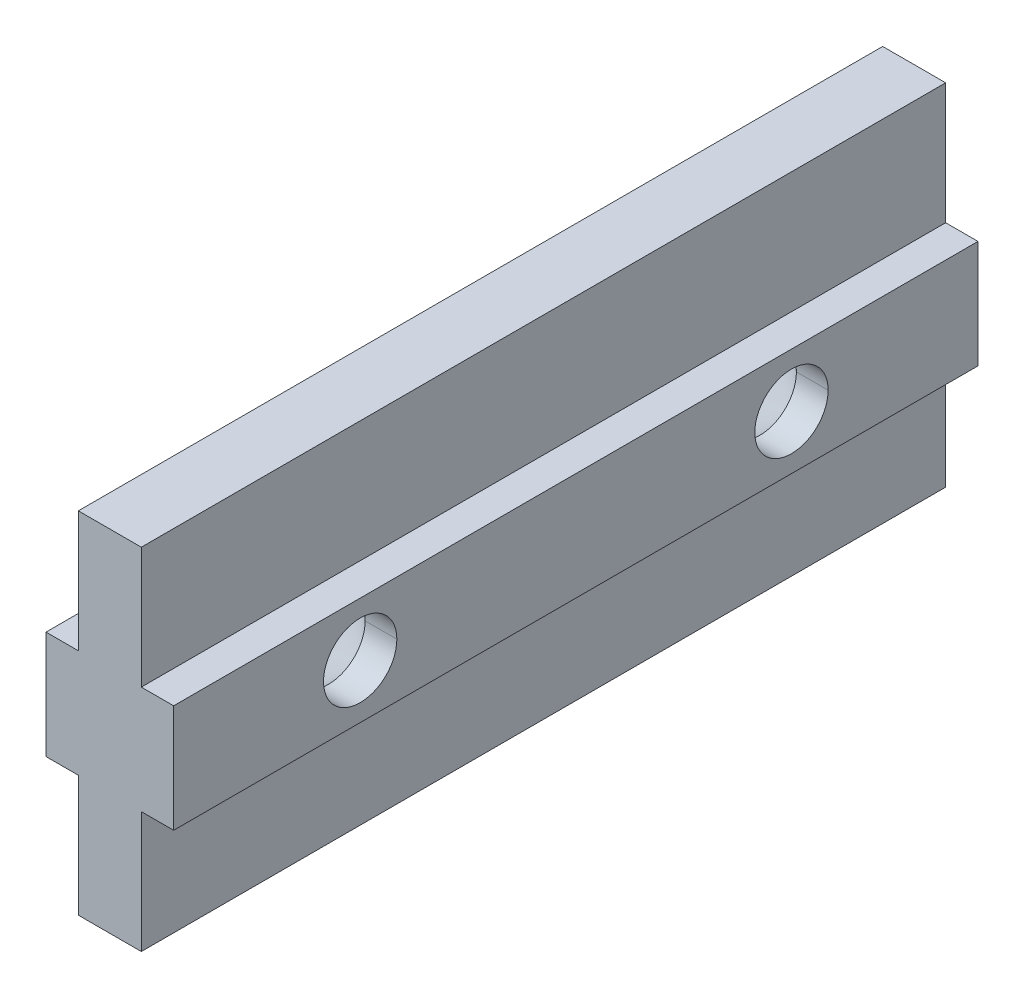
ISO-10303-21;
HEADER;
FILE_DESCRIPTION(('STEP AP214'),'2;1');
FILE_NAME('part.step','',(''),(''),'','','');
FILE_SCHEMA(('AUTOMOTIVE_DESIGN { 1 0 10303 214 1 1 1 1 }'));
ENDSEC;
DATA;
#1=APPLICATION_CONTEXT('core data for automotive mechanical design processes');
#2=APPLICATION_PROTOCOL_DEFINITION('international standard','automotive_design',2000,#1);
#3=PRODUCT_CONTEXT('',#1,'mechanical');
#4=PRODUCT('Part','Part','',(#3));
#5=PRODUCT_RELATED_PRODUCT_CATEGORY('part','',(#4));
#6=PRODUCT_DEFINITION_FORMATION('','',#4);
#7=PRODUCT_DEFINITION_CONTEXT('part definition',#1,'design');
#8=PRODUCT_DEFINITION('design','',#6,#7);
#9=PRODUCT_DEFINITION_SHAPE('','',#8);
#10=(LENGTH_UNIT() NAMED_UNIT(*) SI_UNIT(.MILLI.,.METRE.));
#11=(NAMED_UNIT(*) PLANE_ANGLE_UNIT() SI_UNIT($,.RADIAN.));
#12=(NAMED_UNIT(*) SI_UNIT($,.STERADIAN.) SOLID_ANGLE_UNIT());
#13=UNCERTAINTY_MEASURE_WITH_UNIT(LENGTH_MEASURE(1.E-05),#10,'distance_accuracy_value','');
#14=(GEOMETRIC_REPRESENTATION_CONTEXT(3) GLOBAL_UNCERTAINTY_ASSIGNED_CONTEXT((#13)) GLOBAL_UNIT_ASSIGNED_CONTEXT((#10,
#11,#12)) REPRESENTATION_CONTEXT('',''));
#15=CARTESIAN_POINT('',(0.,0.,0.));
#16=DIRECTION('',(0.,0.,1.));
#17=DIRECTION('',(1.,0.,0.));
#18=AXIS2_PLACEMENT_3D('',#15,#16,#17);
#19=CARTESIAN_POINT('',(-3.7592,0.,-12.7));
#20=DIRECTION('',(1.,0.,0.));
#21=DIRECTION('',(0.,0.,1.));
#22=AXIS2_PLACEMENT_3D('',#19,#20,#21);
#23=CYLINDRICAL_SURFACE('',#22,5.461);
#24=CARTESIAN_POINT('',(-3.7592,0.,-12.7));
#25=DIRECTION('',(-1.,0.,0.));
#26=DIRECTION('',(0.,0.,1.));
#27=AXIS2_PLACEMENT_3D('',#24,#25,#26);
#28=CIRCLE('',#27,5.461);
#29=CARTESIAN_POINT('',(-3.7592,3.175,-17.1431853438721));
#30=VERTEX_POINT('',#29);
#31=CARTESIAN_POINT('',(-3.7592,-3.175,-17.1431853438721));
#32=VERTEX_POINT('',#31);
#33=EDGE_CURVE('E11',#30,#32,#28,.T.);
#34=ORIENTED_EDGE('',*,*,#33,.T.);
#35=DIRECTION('',(-1.,0.,0.));
#36=VECTOR('',#35,1.);
#37=CARTESIAN_POINT('',(-3.7592,-3.175,-17.1431853438721));
#38=LINE('',#37,#36);
#39=CARTESIAN_POINT('',(-1.8542,-3.175,-17.1431853438721));
#40=VERTEX_POINT('',#39);
#41=EDGE_CURVE('E25',#40,#32,#38,.T.);
#42=ORIENTED_EDGE('',*,*,#41,.F.);
#43=CARTESIAN_POINT('',(-1.8542,0.,-12.7));
#44=DIRECTION('',(-1.,0.,0.));
#45=DIRECTION('',(0.,0.,1.));
#46=AXIS2_PLACEMENT_3D('',#43,#44,#45);
#47=CIRCLE('',#46,5.461);
#48=CARTESIAN_POINT('',(-1.85420000008472,0.,-18.1609999999039));
#49=VERTEX_POINT('',#48);
#50=EDGE_CURVE('E577',#49,#40,#47,.T.);
#51=ORIENTED_EDGE('',*,*,#50,.F.);
#52=CARTESIAN_POINT('',(-1.8542,0.,-12.7));
#53=DIRECTION('',(-1.,0.,0.));
#54=DIRECTION('',(0.,0.,1.));
#55=AXIS2_PLACEMENT_3D('',#52,#53,#54);
#56=CIRCLE('',#55,5.461);
#57=CARTESIAN_POINT('',(-1.8542,3.175,-17.1431853438721));
#58=VERTEX_POINT('',#57);
#59=EDGE_CURVE('E573',#58,#49,#56,.T.);
#60=ORIENTED_EDGE('',*,*,#59,.F.);
#61=DIRECTION('',(-1.,0.,0.));
#62=VECTOR('',#61,1.);
#63=CARTESIAN_POINT('',(-3.7592,3.175,-17.1431853438721));
#64=LINE('',#63,#62);
#65=EDGE_CURVE('E569',#58,#30,#64,.T.);
#66=ORIENTED_EDGE('',*,*,#65,.T.);
#67=EDGE_LOOP('',(#34,#42,#51,#60,#66));
#68=FACE_BOUND('',#67,.T.);
#69=ADVANCED_FACE('F17',(#68),#23,.F.);
#70=CARTESIAN_POINT('',(-1.8542,3.175,23.6855));
#71=DIRECTION('',(0.,-1.,0.));
#72=DIRECTION('',(0.,0.,-1.));
#73=AXIS2_PLACEMENT_3D('',#70,#71,#72);
#74=PLANE('',#73);
#75=ORIENTED_EDGE('',*,*,#65,.F.);
#76=DIRECTION('',(0.,0.,-1.));
#77=VECTOR('',#76,1.);
#78=CARTESIAN_POINT('',(-1.8542,3.175,23.6855));
#79=LINE('',#78,#77);
#80=CARTESIAN_POINT('',(-1.8542,3.175,-23.6855));
#81=VERTEX_POINT('',#80);
#82=EDGE_CURVE('E565',#58,#81,#79,.T.);
#83=ORIENTED_EDGE('',*,*,#82,.T.);
#84=DIRECTION('',(-1.,0.,0.));
#85=VECTOR('',#84,1.);
#86=CARTESIAN_POINT('',(-1.8542,3.175,-23.6855));
#87=LINE('',#86,#85);
#88=CARTESIAN_POINT('',(-3.7592,3.175,-23.6855));
#89=VERTEX_POINT('',#88);
#90=EDGE_CURVE('E561',#81,#89,#87,.T.);
#91=ORIENTED_EDGE('',*,*,#90,.T.);
#92=DIRECTION('',(0.,0.,-1.));
#93=VECTOR('',#92,1.);
#94=CARTESIAN_POINT('',(-3.7592,3.175,23.6855));
#95=LINE('',#94,#93);
#96=EDGE_CURVE('E556',#30,#89,#95,.T.);
#97=ORIENTED_EDGE('',*,*,#96,.F.);
#98=EDGE_LOOP('',(#75,#83,#91,#97));
#99=FACE_BOUND('',#98,.T.);
#100=ADVANCED_FACE('F601',(#99),#74,.F.);
#101=CARTESIAN_POINT('',(-3.7592,3.175,23.6855));
#102=DIRECTION('',(1.,0.,0.));
#103=DIRECTION('',(0.,0.,-1.));
#104=AXIS2_PLACEMENT_3D('',#101,#102,#103);
#105=PLANE('',#104);
#106=ORIENTED_EDGE('',*,*,#33,.F.);
#107=ORIENTED_EDGE('',*,*,#96,.T.);
#108=DIRECTION('',(0.,-1.,0.));
#109=VECTOR('',#108,1.);
#110=CARTESIAN_POINT('',(-3.7592,3.175,-23.6855));
#111=LINE('',#110,#109);
#112=CARTESIAN_POINT('',(-3.7592,-3.175,-23.6855));
#113=VERTEX_POINT('',#112);
#114=EDGE_CURVE('E552',#89,#113,#111,.T.);
#115=ORIENTED_EDGE('',*,*,#114,.T.);
#116=DIRECTION('',(0.,0.,-1.));
#117=VECTOR('',#116,1.);
#118=CARTESIAN_POINT('',(-3.7592,-3.175,23.6855));
#119=LINE('',#118,#117);
#120=EDGE_CURVE('E547',#32,#113,#119,.T.);
#121=ORIENTED_EDGE('',*,*,#120,.F.);
#122=EDGE_LOOP('',(#106,#107,#115,#121));
#123=FACE_BOUND('',#122,.T.);
#124=ADVANCED_FACE('F605',(#123),#105,.F.);
#125=CARTESIAN_POINT('',(-3.7592,-3.175,23.6855));
#126=DIRECTION('',(0.,1.,0.));
#127=DIRECTION('',(0.,0.,1.));
#128=AXIS2_PLACEMENT_3D('',#125,#126,#127);
#129=PLANE('',#128);
#130=ORIENTED_EDGE('',*,*,#41,.T.);
#131=ORIENTED_EDGE('',*,*,#120,.T.);
#132=DIRECTION('',(1.,0.,0.));
#133=VECTOR('',#132,1.);
#134=CARTESIAN_POINT('',(-3.7592,-3.175,-23.6855));
#135=LINE('',#134,#133);
#136=CARTESIAN_POINT('',(-1.8542,-3.175,-23.6855));
#137=VERTEX_POINT('',#136);
#138=EDGE_CURVE('E543',#113,#137,#135,.T.);
#139=ORIENTED_EDGE('',*,*,#138,.T.);
#140=DIRECTION('',(0.,0.,-1.));
#141=VECTOR('',#140,1.);
#142=CARTESIAN_POINT('',(-1.8542,-3.175,23.6855));
#143=LINE('',#142,#141);
#144=EDGE_CURVE('E538',#40,#137,#143,.T.);
#145=ORIENTED_EDGE('',*,*,#144,.F.);
#146=EDGE_LOOP('',(#130,#131,#139,#145));
#147=FACE_BOUND('',#146,.T.);
#148=ADVANCED_FACE('F586',(#147),#129,.F.);
#149=CARTESIAN_POINT('',(-1.8542,-3.175,23.6855));
#150=DIRECTION('',(1.,0.,0.));
#151=DIRECTION('',(0.,0.,-1.));
#152=AXIS2_PLACEMENT_3D('',#149,#150,#151);
#153=PLANE('',#152);
#154=CARTESIAN_POINT('',(-1.8542,0.,-12.7));
#155=DIRECTION('',(-1.,0.,0.));
#156=DIRECTION('',(0.,0.,1.));
#157=AXIS2_PLACEMENT_3D('',#154,#155,#156);
#158=CIRCLE('',#157,5.461);
#159=CARTESIAN_POINT('',(-1.8542,-3.175,-8.25681465612788));
#160=VERTEX_POINT('',#159);
#161=EDGE_CURVE('E215',#40,#160,#158,.T.);
#162=ORIENTED_EDGE('',*,*,#161,.F.);
#163=ORIENTED_EDGE('',*,*,#144,.T.);
#164=DIRECTION('',(0.,-1.,0.));
#165=VECTOR('',#164,1.);
#166=CARTESIAN_POINT('',(-1.8542,-3.175,-23.6855));
#167=LINE('',#166,#165);
#168=CARTESIAN_POINT('',(-1.8542,-10.3124,-23.6855));
#169=VERTEX_POINT('',#168);
#170=EDGE_CURVE('E531',#137,#169,#167,.T.);
#171=ORIENTED_EDGE('',*,*,#170,.T.);
#172=DIRECTION('',(0.,0.,-1.));
#173=VECTOR('',#172,1.);
#174=CARTESIAN_POINT('',(-1.8542,-10.3124,23.6855));
#175=LINE('',#174,#173);
#176=CARTESIAN_POINT('',(-1.8542,-10.3124,23.6855));
#177=VERTEX_POINT('',#176);
#178=EDGE_CURVE('E526',#177,#169,#175,.T.);
#179=ORIENTED_EDGE('',*,*,#178,.F.);
#180=DIRECTION('',(0.,-1.,0.));
#181=VECTOR('',#180,1.);
#182=CARTESIAN_POINT('',(-1.8542,-3.175,23.6855));
#183=LINE('',#182,#181);
#184=CARTESIAN_POINT('',(-1.8542,-3.175,23.6855));
#185=VERTEX_POINT('',#184);
#186=EDGE_CURVE('E521',#185,#177,#183,.T.);
#187=ORIENTED_EDGE('',*,*,#186,.F.);
#188=DIRECTION('',(0.,0.,-1.));
#189=VECTOR('',#188,1.);
#190=CARTESIAN_POINT('',(-1.8542,-3.175,23.6855));
#191=LINE('',#190,#189);
#192=CARTESIAN_POINT('',(-1.8542,-3.175,17.1431853438721));
#193=VERTEX_POINT('',#192);
#194=EDGE_CURVE('E517',#185,#193,#191,.T.);
#195=ORIENTED_EDGE('',*,*,#194,.T.);
#196=CARTESIAN_POINT('',(-1.8542,0.,12.7));
#197=DIRECTION('',(-1.,0.,0.));
#198=DIRECTION('',(0.,0.,1.));
#199=AXIS2_PLACEMENT_3D('',#196,#197,#198);
#200=CIRCLE('',#199,5.461);
#201=CARTESIAN_POINT('',(-1.8542,-3.175,8.25681465612788));
#202=VERTEX_POINT('',#201);
#203=EDGE_CURVE('E512',#202,#193,#200,.T.);
#204=ORIENTED_EDGE('',*,*,#203,.F.);
#205=DIRECTION('',(0.,0.,-1.));
#206=VECTOR('',#205,1.);
#207=CARTESIAN_POINT('',(-1.8542,-3.175,23.6855));
#208=LINE('',#207,#206);
#209=EDGE_CURVE('E508',#202,#160,#208,.T.);
#210=ORIENTED_EDGE('',*,*,#209,.T.);
#211=EDGE_LOOP('',(#162,#163,#171,#179,#187,#195,#204,#210));
#212=FACE_BOUND('',#211,.T.);
#213=ADVANCED_FACE('F590',(#212),#153,.F.);
#214=CARTESIAN_POINT('',(-3.7592,-3.175,23.6855));
#215=DIRECTION('',(0.,1.,0.));
#216=DIRECTION('',(0.,0.,1.));
#217=AXIS2_PLACEMENT_3D('',#214,#215,#216);
#218=PLANE('',#217);
#219=DIRECTION('',(-1.,0.,0.));
#220=VECTOR('',#219,1.);
#221=CARTESIAN_POINT('',(-3.7592,-3.175,-8.25681465612788));
#222=LINE('',#221,#220);
#223=CARTESIAN_POINT('',(-3.7592,-3.175,-8.25681465612788));
#224=VERTEX_POINT('',#223);
#225=EDGE_CURVE('E504',#160,#224,#222,.T.);
#226=ORIENTED_EDGE('',*,*,#225,.F.);
#227=ORIENTED_EDGE('',*,*,#209,.F.);
#228=DIRECTION('',(-1.,0.,0.));
#229=VECTOR('',#228,1.);
#230=CARTESIAN_POINT('',(-3.7592,-3.175,8.25681465612788));
#231=LINE('',#230,#229);
#232=CARTESIAN_POINT('',(-3.7592,-3.175,8.25681465612788));
#233=VERTEX_POINT('',#232);
#234=EDGE_CURVE('E500',#202,#233,#231,.T.);
#235=ORIENTED_EDGE('',*,*,#234,.T.);
#236=DIRECTION('',(0.,0.,-1.));
#237=VECTOR('',#236,1.);
#238=CARTESIAN_POINT('',(-3.7592,-3.175,23.6855));
#239=LINE('',#238,#237);
#240=EDGE_CURVE('E496',#233,#224,#239,.T.);
#241=ORIENTED_EDGE('',*,*,#240,.T.);
#242=EDGE_LOOP('',(#226,#227,#235,#241));
#243=FACE_BOUND('',#242,.T.);
#244=ADVANCED_FACE('F626',(#243),#218,.F.);
#245=CARTESIAN_POINT('',(-3.7592,3.175,23.6855));
#246=DIRECTION('',(1.,0.,0.));
#247=DIRECTION('',(0.,0.,-1.));
#248=AXIS2_PLACEMENT_3D('',#245,#246,#247);
#249=PLANE('',#248);
#250=DIRECTION('',(0.,0.,-1.));
#251=VECTOR('',#250,1.);
#252=CARTESIAN_POINT('',(-3.7592,3.175,23.6855));
#253=LINE('',#252,#251);
#254=CARTESIAN_POINT('',(-3.7592,3.175,8.25681465612788));
#255=VERTEX_POINT('',#254);
#256=CARTESIAN_POINT('',(-3.7592,3.175,-8.25681465612788));
#257=VERTEX_POINT('',#256);
#258=EDGE_CURVE('E492',#255,#257,#253,.T.);
#259=ORIENTED_EDGE('',*,*,#258,.T.);
#260=CARTESIAN_POINT('',(-3.7592,0.,-12.7));
#261=DIRECTION('',(-1.,0.,0.));
#262=DIRECTION('',(0.,0.,1.));
#263=AXIS2_PLACEMENT_3D('',#260,#261,#262);
#264=CIRCLE('',#263,5.461);
#265=EDGE_CURVE('E488',#224,#257,#264,.T.);
#266=ORIENTED_EDGE('',*,*,#265,.F.);
#267=ORIENTED_EDGE('',*,*,#240,.F.);
#268=CARTESIAN_POINT('',(-3.7592,0.,12.7));
#269=DIRECTION('',(-1.,0.,0.));
#270=DIRECTION('',(0.,0.,1.));
#271=AXIS2_PLACEMENT_3D('',#268,#269,#270);
#272=CIRCLE('',#271,5.461);
#273=EDGE_CURVE('E483',#255,#233,#272,.T.);
#274=ORIENTED_EDGE('',*,*,#273,.F.);
#275=EDGE_LOOP('',(#259,#266,#267,#274));
#276=FACE_BOUND('',#275,.T.);
#277=ADVANCED_FACE('F641',(#276),#249,.F.);
#278=CARTESIAN_POINT('',(-3.7592,0.,12.7));
#279=DIRECTION('',(1.,0.,0.));
#280=DIRECTION('',(0.,0.,1.));
#281=AXIS2_PLACEMENT_3D('',#278,#279,#280);
#282=CYLINDRICAL_SURFACE('',#281,5.461);
#283=ORIENTED_EDGE('',*,*,#273,.T.);
#284=ORIENTED_EDGE('',*,*,#234,.F.);
#285=CARTESIAN_POINT('',(-1.8542,0.,12.7));
#286=DIRECTION('',(-1.,0.,0.));
#287=DIRECTION('',(0.,0.,1.));
#288=AXIS2_PLACEMENT_3D('',#285,#286,#287);
#289=CIRCLE('',#288,5.461);
#290=CARTESIAN_POINT('',(-1.85420000008472,0.,7.2390000000961));
#291=VERTEX_POINT('',#290);
#292=EDGE_CURVE('E478',#291,#202,#289,.T.);
#293=ORIENTED_EDGE('',*,*,#292,.F.);
#294=CARTESIAN_POINT('',(-1.8542,0.,12.7));
#295=DIRECTION('',(-1.,0.,0.));
#296=DIRECTION('',(0.,0.,1.));
#297=AXIS2_PLACEMENT_3D('',#294,#295,#296);
#298=CIRCLE('',#297,5.461);
#299=CARTESIAN_POINT('',(-1.8542,3.175,8.25681465612788));
#300=VERTEX_POINT('',#299);
#301=EDGE_CURVE('E473',#300,#291,#298,.T.);
#302=ORIENTED_EDGE('',*,*,#301,.F.);
#303=DIRECTION('',(-1.,0.,0.));
#304=VECTOR('',#303,1.);
#305=CARTESIAN_POINT('',(-3.7592,3.175,8.25681465612788));
#306=LINE('',#305,#304);
#307=EDGE_CURVE('E468',#300,#255,#306,.T.);
#308=ORIENTED_EDGE('',*,*,#307,.T.);
#309=EDGE_LOOP('',(#283,#284,#293,#302,#308));
#310=FACE_BOUND('',#309,.T.);
#311=ADVANCED_FACE('F629',(#310),#282,.F.);
#312=CARTESIAN_POINT('',(-1.8542,3.175,23.6855));
#313=DIRECTION('',(0.,-1.,0.));
#314=DIRECTION('',(0.,0.,-1.));
#315=AXIS2_PLACEMENT_3D('',#312,#313,#314);
#316=PLANE('',#315);
#317=DIRECTION('',(-1.,0.,0.));
#318=VECTOR('',#317,1.);
#319=CARTESIAN_POINT('',(-3.7592,3.175,-8.25681465612788));
#320=LINE('',#319,#318);
#321=CARTESIAN_POINT('',(-1.8542,3.175,-8.25681465612788));
#322=VERTEX_POINT('',#321);
#323=EDGE_CURVE('E210',#322,#257,#320,.T.);
#324=ORIENTED_EDGE('',*,*,#323,.T.);
#325=ORIENTED_EDGE('',*,*,#258,.F.);
#326=ORIENTED_EDGE('',*,*,#307,.F.);
#327=DIRECTION('',(0.,0.,-1.));
#328=VECTOR('',#327,1.);
#329=CARTESIAN_POINT('',(-1.8542,3.175,23.6855));
#330=LINE('',#329,#328);
#331=EDGE_CURVE('E461',#300,#322,#330,.T.);
#332=ORIENTED_EDGE('',*,*,#331,.T.);
#333=EDGE_LOOP('',(#324,#325,#326,#332));
#334=FACE_BOUND('',#333,.T.);
#335=ADVANCED_FACE('F638',(#334),#316,.F.);
#336=CARTESIAN_POINT('',(-1.8542,10.3124,23.6855));
#337=DIRECTION('',(1.,0.,0.));
#338=DIRECTION('',(0.,0.,-1.));
#339=AXIS2_PLACEMENT_3D('',#336,#337,#338);
#340=PLANE('',#339);
#341=CARTESIAN_POINT('',(-1.8542,0.,-12.7));
#342=DIRECTION('',(1.,0.,0.));
#343=DIRECTION('',(0.,0.,-1.));
#344=AXIS2_PLACEMENT_3D('',#341,#342,#343);
#345=CIRCLE('',#344,5.461);
#346=EDGE_CURVE('E456',#58,#322,#345,.T.);
#347=ORIENTED_EDGE('',*,*,#346,.T.);
#348=ORIENTED_EDGE('',*,*,#331,.F.);
#349=CARTESIAN_POINT('',(-1.8542,0.,12.7));
#350=DIRECTION('',(-1.,0.,0.));
#351=DIRECTION('',(0.,0.,1.));
#352=AXIS2_PLACEMENT_3D('',#349,#350,#351);
#353=CIRCLE('',#352,5.461);
#354=CARTESIAN_POINT('',(-1.8542,3.175,17.1431853438721));
#355=VERTEX_POINT('',#354);
#356=EDGE_CURVE('E451',#355,#300,#353,.T.);
#357=ORIENTED_EDGE('',*,*,#356,.F.);
#358=DIRECTION('',(0.,0.,-1.));
#359=VECTOR('',#358,1.);
#360=CARTESIAN_POINT('',(-1.8542,3.175,23.6855));
#361=LINE('',#360,#359);
#362=CARTESIAN_POINT('',(-1.8542,3.175,23.6855));
#363=VERTEX_POINT('',#362);
#364=EDGE_CURVE('E446',#363,#355,#361,.T.);
#365=ORIENTED_EDGE('',*,*,#364,.F.);
#366=DIRECTION('',(0.,-1.,0.));
#367=VECTOR('',#366,1.);
#368=CARTESIAN_POINT('',(-1.8542,10.3124,23.6855));
#369=LINE('',#368,#367);
#370=CARTESIAN_POINT('',(-1.8542,10.3124,23.6855));
#371=VERTEX_POINT('',#370);
#372=EDGE_CURVE('E441',#371,#363,#369,.T.);
#373=ORIENTED_EDGE('',*,*,#372,.F.);
#374=DIRECTION('',(0.,0.,-1.));
#375=VECTOR('',#374,1.);
#376=CARTESIAN_POINT('',(-1.8542,10.3124,23.6855));
#377=LINE('',#376,#375);
#378=CARTESIAN_POINT('',(-1.8542,10.3124,-23.6855));
#379=VERTEX_POINT('',#378);
#380=EDGE_CURVE('E437',#371,#379,#377,.T.);
#381=ORIENTED_EDGE('',*,*,#380,.T.);
#382=DIRECTION('',(0.,-1.,0.));
#383=VECTOR('',#382,1.);
#384=CARTESIAN_POINT('',(-1.8542,10.3124,-23.6855));
#385=LINE('',#384,#383);
#386=EDGE_CURVE('E432',#379,#81,#385,.T.);
#387=ORIENTED_EDGE('',*,*,#386,.T.);
#388=ORIENTED_EDGE('',*,*,#82,.F.);
#389=EDGE_LOOP('',(#347,#348,#357,#365,#373,#381,#387,#388));
#390=FACE_BOUND('',#389,.T.);
#391=ADVANCED_FACE('F597',(#390),#340,.F.);
#392=CARTESIAN_POINT('',(0.,0.,-23.6855));
#393=DIRECTION('',(0.,0.,1.));
#394=DIRECTION('',(1.,0.,0.));
#395=AXIS2_PLACEMENT_3D('',#392,#393,#394);
#396=PLANE('',#395);
#397=ORIENTED_EDGE('',*,*,#114,.F.);
#398=ORIENTED_EDGE('',*,*,#90,.F.);
#399=ORIENTED_EDGE('',*,*,#386,.F.);
#400=DIRECTION('',(-1.,0.,0.));
#401=VECTOR('',#400,1.);
#402=CARTESIAN_POINT('',(1.8542,10.3124,-23.6855));
#403=LINE('',#402,#401);
#404=CARTESIAN_POINT('',(1.8542,10.3124,-23.6855));
#405=VERTEX_POINT('',#404);
#406=EDGE_CURVE('E427',#405,#379,#403,.T.);
#407=ORIENTED_EDGE('',*,*,#406,.F.);
#408=DIRECTION('',(0.,1.,0.));
#409=VECTOR('',#408,1.);
#410=CARTESIAN_POINT('',(1.8542,3.175,-23.6855));
#411=LINE('',#410,#409);
#412=CARTESIAN_POINT('',(1.8542,3.175,-23.6855));
#413=VERTEX_POINT('',#412);
#414=EDGE_CURVE('E422',#413,#405,#411,.T.);
#415=ORIENTED_EDGE('',*,*,#414,.F.);
#416=DIRECTION('',(-1.,0.,0.));
#417=VECTOR('',#416,1.);
#418=CARTESIAN_POINT('',(3.7592,3.175,-23.6855));
#419=LINE('',#418,#417);
#420=CARTESIAN_POINT('',(3.7592,3.175,-23.6855));
#421=VERTEX_POINT('',#420);
#422=EDGE_CURVE('E417',#421,#413,#419,.T.);
#423=ORIENTED_EDGE('',*,*,#422,.F.);
#424=DIRECTION('',(0.,1.,0.));
#425=VECTOR('',#424,1.);
#426=CARTESIAN_POINT('',(3.7592,-3.175,-23.6855));
#427=LINE('',#426,#425);
#428=CARTESIAN_POINT('',(3.7592,-3.175,-23.6855));
#429=VERTEX_POINT('',#428);
#430=EDGE_CURVE('E412',#429,#421,#427,.T.);
#431=ORIENTED_EDGE('',*,*,#430,.F.);
#432=DIRECTION('',(1.,0.,0.));
#433=VECTOR('',#432,1.);
#434=CARTESIAN_POINT('',(1.8542,-3.175,-23.6855));
#435=LINE('',#434,#433);
#436=CARTESIAN_POINT('',(1.8542,-3.175,-23.6855));
#437=VERTEX_POINT('',#436);
#438=EDGE_CURVE('E407',#437,#429,#435,.T.);
#439=ORIENTED_EDGE('',*,*,#438,.F.);
#440=DIRECTION('',(0.,1.,0.));
#441=VECTOR('',#440,1.);
#442=CARTESIAN_POINT('',(1.8542,-10.3124,-23.6855));
#443=LINE('',#442,#441);
#444=CARTESIAN_POINT('',(1.8542,-10.3124,-23.6855));
#445=VERTEX_POINT('',#444);
#446=EDGE_CURVE('E402',#445,#437,#443,.T.);
#447=ORIENTED_EDGE('',*,*,#446,.F.);
#448=DIRECTION('',(1.,0.,0.));
#449=VECTOR('',#448,1.);
#450=CARTESIAN_POINT('',(-1.8542,-10.3124,-23.6855));
#451=LINE('',#450,#449);
#452=EDGE_CURVE('E397',#169,#445,#451,.T.);
#453=ORIENTED_EDGE('',*,*,#452,.F.);
#454=ORIENTED_EDGE('',*,*,#170,.F.);
#455=ORIENTED_EDGE('',*,*,#138,.F.);
#456=EDGE_LOOP('',(#397,#398,#399,#407,#415,#423,#431,#439,#447,#453,#454,#455));
#457=FACE_BOUND('',#456,.T.);
#458=ADVANCED_FACE('F607',(#457),#396,.F.);
#459=CARTESIAN_POINT('',(-1.8542,-10.3124,23.6855));
#460=DIRECTION('',(0.,1.,0.));
#461=DIRECTION('',(0.,0.,1.));
#462=AXIS2_PLACEMENT_3D('',#459,#460,#461);
#463=PLANE('',#462);
#464=ORIENTED_EDGE('',*,*,#452,.T.);
#465=DIRECTION('',(0.,0.,-1.));
#466=VECTOR('',#465,1.);
#467=CARTESIAN_POINT('',(1.8542,-10.3124,23.6855));
#468=LINE('',#467,#466);
#469=CARTESIAN_POINT('',(1.8542,-10.3124,23.6855));
#470=VERTEX_POINT('',#469);
#471=EDGE_CURVE('E392',#470,#445,#468,.T.);
#472=ORIENTED_EDGE('',*,*,#471,.F.);
#473=DIRECTION('',(1.,0.,0.));
#474=VECTOR('',#473,1.);
#475=CARTESIAN_POINT('',(-1.8542,-10.3124,23.6855));
#476=LINE('',#475,#474);
#477=EDGE_CURVE('E387',#177,#470,#476,.T.);
#478=ORIENTED_EDGE('',*,*,#477,.F.);
#479=ORIENTED_EDGE('',*,*,#178,.T.);
#480=EDGE_LOOP('',(#464,#472,#478,#479));
#481=FACE_BOUND('',#480,.T.);
#482=ADVANCED_FACE('F611',(#481),#463,.F.);
#483=CARTESIAN_POINT('',(0.,0.,23.6855));
#484=DIRECTION('',(0.,0.,1.));
#485=DIRECTION('',(1.,0.,0.));
#486=AXIS2_PLACEMENT_3D('',#483,#484,#485);
#487=PLANE('',#486);
#488=DIRECTION('',(0.,-1.,0.));
#489=VECTOR('',#488,1.);
#490=CARTESIAN_POINT('',(-3.7592,3.175,23.6855));
#491=LINE('',#490,#489);
#492=CARTESIAN_POINT('',(-3.7592,3.175,23.6855));
#493=VERTEX_POINT('',#492);
#494=CARTESIAN_POINT('',(-3.7592,-3.175,23.6855));
#495=VERTEX_POINT('',#494);
#496=EDGE_CURVE('E383',#493,#495,#491,.T.);
#497=ORIENTED_EDGE('',*,*,#496,.T.);
#498=DIRECTION('',(1.,0.,0.));
#499=VECTOR('',#498,1.);
#500=CARTESIAN_POINT('',(-3.7592,-3.175,23.6855));
#501=LINE('',#500,#499);
#502=EDGE_CURVE('E378',#495,#185,#501,.T.);
#503=ORIENTED_EDGE('',*,*,#502,.T.);
#504=ORIENTED_EDGE('',*,*,#186,.T.);
#505=ORIENTED_EDGE('',*,*,#477,.T.);
#506=DIRECTION('',(0.,1.,0.));
#507=VECTOR('',#506,1.);
#508=CARTESIAN_POINT('',(1.8542,-10.3124,23.6855));
#509=LINE('',#508,#507);
#510=CARTESIAN_POINT('',(1.8542,-3.175,23.6855));
#511=VERTEX_POINT('',#510);
#512=EDGE_CURVE('E374',#470,#511,#509,.T.);
#513=ORIENTED_EDGE('',*,*,#512,.T.);
#514=DIRECTION('',(1.,0.,0.));
#515=VECTOR('',#514,1.);
#516=CARTESIAN_POINT('',(1.8542,-3.175,23.6855));
#517=LINE('',#516,#515);
#518=CARTESIAN_POINT('',(3.7592,-3.175,23.6855));
#519=VERTEX_POINT('',#518);
#520=EDGE_CURVE('E370',#511,#519,#517,.T.);
#521=ORIENTED_EDGE('',*,*,#520,.T.);
#522=DIRECTION('',(0.,1.,0.));
#523=VECTOR('',#522,1.);
#524=CARTESIAN_POINT('',(3.7592,-3.175,23.6855));
#525=LINE('',#524,#523);
#526=CARTESIAN_POINT('',(3.7592,3.175,23.6855));
#527=VERTEX_POINT('',#526);
#528=EDGE_CURVE('E366',#519,#527,#525,.T.);
#529=ORIENTED_EDGE('',*,*,#528,.T.);
#530=DIRECTION('',(-1.,0.,0.));
#531=VECTOR('',#530,1.);
#532=CARTESIAN_POINT('',(3.7592,3.175,23.6855));
#533=LINE('',#532,#531);
#534=CARTESIAN_POINT('',(1.8542,3.175,23.6855));
#535=VERTEX_POINT('',#534);
#536=EDGE_CURVE('E362',#527,#535,#533,.T.);
#537=ORIENTED_EDGE('',*,*,#536,.T.);
#538=DIRECTION('',(0.,1.,0.));
#539=VECTOR('',#538,1.);
#540=CARTESIAN_POINT('',(1.8542,3.175,23.6855));
#541=LINE('',#540,#539);
#542=CARTESIAN_POINT('',(1.8542,10.3124,23.6855));
#543=VERTEX_POINT('',#542);
#544=EDGE_CURVE('E358',#535,#543,#541,.T.);
#545=ORIENTED_EDGE('',*,*,#544,.T.);
#546=DIRECTION('',(-1.,0.,0.));
#547=VECTOR('',#546,1.);
#548=CARTESIAN_POINT('',(1.8542,10.3124,23.6855));
#549=LINE('',#548,#547);
#550=EDGE_CURVE('E353',#543,#371,#549,.T.);
#551=ORIENTED_EDGE('',*,*,#550,.T.);
#552=ORIENTED_EDGE('',*,*,#372,.T.);
#553=DIRECTION('',(-1.,0.,0.));
#554=VECTOR('',#553,1.);
#555=CARTESIAN_POINT('',(-1.8542,3.175,23.6855));
#556=LINE('',#555,#554);
#557=EDGE_CURVE('E349',#363,#493,#556,.T.);
#558=ORIENTED_EDGE('',*,*,#557,.T.);
#559=EDGE_LOOP('',(#497,#503,#504,#505,#513,#521,#529,#537,#545,#551,#552,#558));
#560=FACE_BOUND('',#559,.T.);
#561=ADVANCED_FACE('F614',(#560),#487,.T.);
#562=CARTESIAN_POINT('',(-1.8542,3.175,23.6855));
#563=DIRECTION('',(0.,-1.,0.));
#564=DIRECTION('',(0.,0.,-1.));
#565=AXIS2_PLACEMENT_3D('',#562,#563,#564);
#566=PLANE('',#565);
#567=DIRECTION('',(-1.,0.,0.));
#568=VECTOR('',#567,1.);
#569=CARTESIAN_POINT('',(-3.7592,3.175,17.1431853438721));
#570=LINE('',#569,#568);
#571=CARTESIAN_POINT('',(-3.7592,3.175,17.1431853438721));
#572=VERTEX_POINT('',#571);
#573=EDGE_CURVE('E345',#355,#572,#570,.T.);
#574=ORIENTED_EDGE('',*,*,#573,.T.);
#575=DIRECTION('',(0.,0.,-1.));
#576=VECTOR('',#575,1.);
#577=CARTESIAN_POINT('',(-3.7592,3.175,23.6855));
#578=LINE('',#577,#576);
#579=EDGE_CURVE('E340',#493,#572,#578,.T.);
#580=ORIENTED_EDGE('',*,*,#579,.F.);
#581=ORIENTED_EDGE('',*,*,#557,.F.);
#582=ORIENTED_EDGE('',*,*,#364,.T.);
#583=EDGE_LOOP('',(#574,#580,#581,#582));
#584=FACE_BOUND('',#583,.T.);
#585=ADVANCED_FACE('F726',(#584),#566,.F.);
#586=CARTESIAN_POINT('',(-3.7592,3.175,23.6855));
#587=DIRECTION('',(1.,0.,0.));
#588=DIRECTION('',(0.,0.,-1.));
#589=AXIS2_PLACEMENT_3D('',#586,#587,#588);
#590=PLANE('',#589);
#591=ORIENTED_EDGE('',*,*,#579,.T.);
#592=CARTESIAN_POINT('',(-3.7592,0.,12.7));
#593=DIRECTION('',(-1.,0.,0.));
#594=DIRECTION('',(0.,0.,1.));
#595=AXIS2_PLACEMENT_3D('',#592,#593,#594);
#596=CIRCLE('',#595,5.461);
#597=CARTESIAN_POINT('',(-3.7592,-3.175,17.1431853438721));
#598=VERTEX_POINT('',#597);
#599=EDGE_CURVE('E335',#598,#572,#596,.T.);
#600=ORIENTED_EDGE('',*,*,#599,.F.);
#601=DIRECTION('',(0.,0.,-1.));
#602=VECTOR('',#601,1.);
#603=CARTESIAN_POINT('',(-3.7592,-3.175,23.6855));
#604=LINE('',#603,#602);
#605=EDGE_CURVE('E330',#495,#598,#604,.T.);
#606=ORIENTED_EDGE('',*,*,#605,.F.);
#607=ORIENTED_EDGE('',*,*,#496,.F.);
#608=EDGE_LOOP('',(#591,#600,#606,#607));
#609=FACE_BOUND('',#608,.T.);
#610=ADVANCED_FACE('F735',(#609),#590,.F.);
#611=CARTESIAN_POINT('',(-3.7592,-3.175,23.6855));
#612=DIRECTION('',(0.,1.,0.));
#613=DIRECTION('',(0.,0.,1.));
#614=AXIS2_PLACEMENT_3D('',#611,#612,#613);
#615=PLANE('',#614);
#616=DIRECTION('',(-1.,0.,0.));
#617=VECTOR('',#616,1.);
#618=CARTESIAN_POINT('',(-3.7592,-3.175,17.1431853438721));
#619=LINE('',#618,#617);
#620=EDGE_CURVE('E325',#193,#598,#619,.T.);
#621=ORIENTED_EDGE('',*,*,#620,.F.);
#622=ORIENTED_EDGE('',*,*,#194,.F.);
#623=ORIENTED_EDGE('',*,*,#502,.F.);
#624=ORIENTED_EDGE('',*,*,#605,.T.);
#625=EDGE_LOOP('',(#621,#622,#623,#624));
#626=FACE_BOUND('',#625,.T.);
#627=ADVANCED_FACE('F621',(#626),#615,.F.);
#628=CARTESIAN_POINT('',(-3.7592,0.,12.7));
#629=DIRECTION('',(1.,0.,0.));
#630=DIRECTION('',(0.,0.,-1.));
#631=AXIS2_PLACEMENT_3D('',#628,#629,#630);
#632=CYLINDRICAL_SURFACE('',#631,5.461);
#633=CARTESIAN_POINT('',(-1.8542,0.,12.7));
#634=DIRECTION('',(-1.,0.,0.));
#635=DIRECTION('',(0.,0.,1.));
#636=AXIS2_PLACEMENT_3D('',#633,#634,#635);
#637=CIRCLE('',#636,5.461);
#638=CARTESIAN_POINT('',(-1.85420000008472,0.,18.1609999999039));
#639=VERTEX_POINT('',#638);
#640=EDGE_CURVE('E320',#639,#355,#637,.T.);
#641=ORIENTED_EDGE('',*,*,#640,.F.);
#642=CARTESIAN_POINT('',(-1.8542,0.,12.7));
#643=DIRECTION('',(-1.,0.,0.));
#644=DIRECTION('',(0.,0.,1.));
#645=AXIS2_PLACEMENT_3D('',#642,#643,#644);
#646=CIRCLE('',#645,5.461);
#647=EDGE_CURVE('E315',#193,#639,#646,.T.);
#648=ORIENTED_EDGE('',*,*,#647,.F.);
#649=ORIENTED_EDGE('',*,*,#620,.T.);
#650=ORIENTED_EDGE('',*,*,#599,.T.);
#651=ORIENTED_EDGE('',*,*,#573,.F.);
#652=EDGE_LOOP('',(#641,#648,#649,#650,#651));
#653=FACE_BOUND('',#652,.T.);
#654=ADVANCED_FACE('F754',(#653),#632,.F.);
#655=CARTESIAN_POINT('',(1.8911838072413,0.,12.7));
#656=DIRECTION('',(-1.,0.,0.));
#657=DIRECTION('',(0.,1.,0.));
#658=AXIS2_PLACEMENT_3D('',#655,#656,#657);
#659=CONICAL_SURFACE('',#658,2.159,0.7225663103);
#660=CARTESIAN_POINT('',(1.8911838072413,0.,12.7));
#661=DIRECTION('',(-1.,0.,0.));
#662=DIRECTION('',(0.,0.,1.));
#663=AXIS2_PLACEMENT_3D('',#660,#661,#662);
#664=CIRCLE('',#663,2.159);
#665=CARTESIAN_POINT('',(1.8911838072413,0.,10.541));
#666=VERTEX_POINT('',#665);
#667=CARTESIAN_POINT('',(1.8911838072413,0.,14.859));
#668=VERTEX_POINT('',#667);
#669=EDGE_CURVE('E310',#666,#668,#664,.T.);
#670=ORIENTED_EDGE('',*,*,#669,.F.);
#671=DIRECTION('',(-0.750111069647424,0.,-0.66131186530441));
#672=VECTOR('',#671,1.);
#673=CARTESIAN_POINT('',(1.8911838072413,0.,10.541));
#674=LINE('',#673,#672);
#675=EDGE_CURVE('E305',#666,#291,#674,.T.);
#676=ORIENTED_EDGE('',*,*,#675,.T.);
#677=ORIENTED_EDGE('',*,*,#292,.T.);
#678=ORIENTED_EDGE('',*,*,#203,.T.);
#679=ORIENTED_EDGE('',*,*,#647,.T.);
#680=DIRECTION('',(-0.750111069647423,0.,0.66131186530441));
#681=VECTOR('',#680,1.);
#682=CARTESIAN_POINT('',(1.8911838072413,0.,14.859));
#683=LINE('',#682,#681);
#684=EDGE_CURVE('E300',#668,#639,#683,.T.);
#685=ORIENTED_EDGE('',*,*,#684,.F.);
#686=EDGE_LOOP('',(#670,#676,#677,#678,#679,#685));
#687=FACE_BOUND('',#686,.T.);
#688=ADVANCED_FACE('F630',(#687),#659,.F.);
#689=CARTESIAN_POINT('',(1.8911838072413,0.,12.7));
#690=DIRECTION('',(-1.,0.,0.));
#691=DIRECTION('',(0.,-1.,0.));
#692=AXIS2_PLACEMENT_3D('',#689,#690,#691);
#693=CONICAL_SURFACE('',#692,2.159,0.7225663103);
#694=ORIENTED_EDGE('',*,*,#301,.T.);
#695=ORIENTED_EDGE('',*,*,#675,.F.);
#696=CARTESIAN_POINT('',(1.8911838072413,0.,12.7));
#697=DIRECTION('',(-1.,0.,0.));
#698=DIRECTION('',(0.,0.,1.));
#699=AXIS2_PLACEMENT_3D('',#696,#697,#698);
#700=CIRCLE('',#699,2.159);
#701=EDGE_CURVE('E295',#668,#666,#700,.T.);
#702=ORIENTED_EDGE('',*,*,#701,.F.);
#703=ORIENTED_EDGE('',*,*,#684,.T.);
#704=ORIENTED_EDGE('',*,*,#640,.T.);
#705=ORIENTED_EDGE('',*,*,#356,.T.);
#706=EDGE_LOOP('',(#694,#695,#702,#703,#704,#705));
#707=FACE_BOUND('',#706,.T.);
#708=ADVANCED_FACE('F634',(#707),#693,.F.);
#709=CARTESIAN_POINT('',(-3.7592,0.,12.7));
#710=DIRECTION('',(1.,0.,0.));
#711=DIRECTION('',(0.,-1.,0.));
#712=AXIS2_PLACEMENT_3D('',#709,#710,#711);
#713=CYLINDRICAL_SURFACE('',#712,2.159);
#714=ORIENTED_EDGE('',*,*,#701,.T.);
#715=DIRECTION('',(1.,0.,0.));
#716=VECTOR('',#715,1.);
#717=CARTESIAN_POINT('',(1.8911838072413,0.,10.541));
#718=LINE('',#717,#716);
#719=CARTESIAN_POINT('',(3.7592,0.,10.541));
#720=VERTEX_POINT('',#719);
#721=EDGE_CURVE('E291',#666,#720,#718,.T.);
#722=ORIENTED_EDGE('',*,*,#721,.T.);
#723=CARTESIAN_POINT('',(3.7592,0.,12.7));
#724=DIRECTION('',(-1.,0.,0.));
#725=DIRECTION('',(0.,0.,1.));
#726=AXIS2_PLACEMENT_3D('',#723,#724,#725);
#727=CIRCLE('',#726,2.159);
#728=CARTESIAN_POINT('',(3.7592,0.,14.859));
#729=VERTEX_POINT('',#728);
#730=EDGE_CURVE('E286',#729,#720,#727,.T.);
#731=ORIENTED_EDGE('',*,*,#730,.F.);
#732=DIRECTION('',(1.,0.,0.));
#733=VECTOR('',#732,1.);
#734=CARTESIAN_POINT('',(1.8911838072413,0.,14.859));
#735=LINE('',#734,#733);
#736=EDGE_CURVE('E281',#668,#729,#735,.T.);
#737=ORIENTED_EDGE('',*,*,#736,.F.);
#738=EDGE_LOOP('',(#714,#722,#731,#737));
#739=FACE_BOUND('',#738,.T.);
#740=ADVANCED_FACE('F780',(#739),#713,.F.);
#741=CARTESIAN_POINT('',(-3.7592,0.,12.7));
#742=DIRECTION('',(1.,0.,0.));
#743=DIRECTION('',(0.,1.,0.));
#744=AXIS2_PLACEMENT_3D('',#741,#742,#743);
#745=CYLINDRICAL_SURFACE('',#744,2.159);
#746=CARTESIAN_POINT('',(3.7592,0.,12.7));
#747=DIRECTION('',(-1.,0.,0.));
#748=DIRECTION('',(0.,0.,1.));
#749=AXIS2_PLACEMENT_3D('',#746,#747,#748);
#750=CIRCLE('',#749,2.159);
#751=EDGE_CURVE('E276',#720,#729,#750,.T.);
#752=ORIENTED_EDGE('',*,*,#751,.F.);
#753=ORIENTED_EDGE('',*,*,#721,.F.);
#754=ORIENTED_EDGE('',*,*,#669,.T.);
#755=ORIENTED_EDGE('',*,*,#736,.T.);
#756=EDGE_LOOP('',(#752,#753,#754,#755));
#757=FACE_BOUND('',#756,.T.);
#758=ADVANCED_FACE('F789',(#757),#745,.F.);
#759=CARTESIAN_POINT('',(3.7592,-3.175,23.6855));
#760=DIRECTION('',(-1.,0.,0.));
#761=DIRECTION('',(0.,0.,1.));
#762=AXIS2_PLACEMENT_3D('',#759,#760,#761);
#763=PLANE('',#762);
#764=CARTESIAN_POINT('',(3.7592,0.,-12.7));
#765=DIRECTION('',(-1.,0.,0.));
#766=DIRECTION('',(0.,0.,1.));
#767=AXIS2_PLACEMENT_3D('',#764,#765,#766);
#768=CIRCLE('',#767,2.159);
#769=CARTESIAN_POINT('',(3.7592,0.,-10.541));
#770=VERTEX_POINT('',#769);
#771=CARTESIAN_POINT('',(3.7592,0.,-14.859));
#772=VERTEX_POINT('',#771);
#773=EDGE_CURVE('E272',#770,#772,#768,.T.);
#774=ORIENTED_EDGE('',*,*,#773,.T.);
#775=CARTESIAN_POINT('',(3.7592,0.,-12.7));
#776=DIRECTION('',(-1.,0.,0.));
#777=DIRECTION('',(0.,0.,1.));
#778=AXIS2_PLACEMENT_3D('',#775,#776,#777);
#779=CIRCLE('',#778,2.159);
#780=EDGE_CURVE('E268',#772,#770,#779,.T.);
#781=ORIENTED_EDGE('',*,*,#780,.T.);
#782=EDGE_LOOP('',(#774,#781));
#783=FACE_BOUND('',#782,.T.);
#784=ORIENTED_EDGE('',*,*,#730,.T.);
#785=ORIENTED_EDGE('',*,*,#751,.T.);
#786=EDGE_LOOP('',(#784,#785));
#787=FACE_BOUND('',#786,.T.);
#788=ORIENTED_EDGE('',*,*,#430,.T.);
#789=DIRECTION('',(0.,0.,-1.));
#790=VECTOR('',#789,1.);
#791=CARTESIAN_POINT('',(3.7592,3.175,23.6855));
#792=LINE('',#791,#790);
#793=EDGE_CURVE('E263',#527,#421,#792,.T.);
#794=ORIENTED_EDGE('',*,*,#793,.F.);
#795=ORIENTED_EDGE('',*,*,#528,.F.);
#796=DIRECTION('',(0.,0.,-1.));
#797=VECTOR('',#796,1.);
#798=CARTESIAN_POINT('',(3.7592,-3.175,23.6855));
#799=LINE('',#798,#797);
#800=EDGE_CURVE('E258',#519,#429,#799,.T.);
#801=ORIENTED_EDGE('',*,*,#800,.T.);
#802=EDGE_LOOP('',(#788,#794,#795,#801));
#803=FACE_BOUND('',#802,.T.);
#804=ADVANCED_FACE('F799',(#783,#787,#803),#763,.F.);
#805=CARTESIAN_POINT('',(1.8542,-3.175,23.6855));
#806=DIRECTION('',(0.,1.,0.));
#807=DIRECTION('',(0.,0.,1.));
#808=AXIS2_PLACEMENT_3D('',#805,#806,#807);
#809=PLANE('',#808);
#810=ORIENTED_EDGE('',*,*,#438,.T.);
#811=ORIENTED_EDGE('',*,*,#800,.F.);
#812=ORIENTED_EDGE('',*,*,#520,.F.);
#813=DIRECTION('',(0.,0.,-1.));
#814=VECTOR('',#813,1.);
#815=CARTESIAN_POINT('',(1.8542,-3.175,23.6855));
#816=LINE('',#815,#814);
#817=EDGE_CURVE('E253',#511,#437,#816,.T.);
#818=ORIENTED_EDGE('',*,*,#817,.T.);
#819=EDGE_LOOP('',(#810,#811,#812,#818));
#820=FACE_BOUND('',#819,.T.);
#821=ADVANCED_FACE('F809',(#820),#809,.F.);
#822=CARTESIAN_POINT('',(1.8542,-10.3124,23.6855));
#823=DIRECTION('',(-1.,0.,0.));
#824=DIRECTION('',(0.,0.,1.));
#825=AXIS2_PLACEMENT_3D('',#822,#823,#824);
#826=PLANE('',#825);
#827=ORIENTED_EDGE('',*,*,#446,.T.);
#828=ORIENTED_EDGE('',*,*,#817,.F.);
#829=ORIENTED_EDGE('',*,*,#512,.F.);
#830=ORIENTED_EDGE('',*,*,#471,.T.);
#831=EDGE_LOOP('',(#827,#828,#829,#830));
#832=FACE_BOUND('',#831,.T.);
#833=ADVANCED_FACE('F819',(#832),#826,.F.);
#834=CARTESIAN_POINT('',(3.7592,3.175,23.6855));
#835=DIRECTION('',(0.,-1.,0.));
#836=DIRECTION('',(0.,0.,-1.));
#837=AXIS2_PLACEMENT_3D('',#834,#835,#836);
#838=PLANE('',#837);
#839=ORIENTED_EDGE('',*,*,#422,.T.);
#840=DIRECTION('',(0.,0.,-1.));
#841=VECTOR('',#840,1.);
#842=CARTESIAN_POINT('',(1.8542,3.175,23.6855));
#843=LINE('',#842,#841);
#844=EDGE_CURVE('E248',#535,#413,#843,.T.);
#845=ORIENTED_EDGE('',*,*,#844,.F.);
#846=ORIENTED_EDGE('',*,*,#536,.F.);
#847=ORIENTED_EDGE('',*,*,#793,.T.);
#848=EDGE_LOOP('',(#839,#845,#846,#847));
#849=FACE_BOUND('',#848,.T.);
#850=ADVANCED_FACE('F829',(#849),#838,.F.);
#851=CARTESIAN_POINT('',(1.8542,3.175,23.6855));
#852=DIRECTION('',(-1.,0.,0.));
#853=DIRECTION('',(0.,0.,1.));
#854=AXIS2_PLACEMENT_3D('',#851,#852,#853);
#855=PLANE('',#854);
#856=ORIENTED_EDGE('',*,*,#414,.T.);
#857=DIRECTION('',(0.,0.,-1.));
#858=VECTOR('',#857,1.);
#859=CARTESIAN_POINT('',(1.8542,10.3124,23.6855));
#860=LINE('',#859,#858);
#861=EDGE_CURVE('E243',#543,#405,#860,.T.);
#862=ORIENTED_EDGE('',*,*,#861,.F.);
#863=ORIENTED_EDGE('',*,*,#544,.F.);
#864=ORIENTED_EDGE('',*,*,#844,.T.);
#865=EDGE_LOOP('',(#856,#862,#863,#864));
#866=FACE_BOUND('',#865,.T.);
#867=ADVANCED_FACE('F839',(#866),#855,.F.);
#868=CARTESIAN_POINT('',(1.8542,10.3124,23.6855));
#869=DIRECTION('',(0.,-1.,0.));
#870=DIRECTION('',(0.,0.,-1.));
#871=AXIS2_PLACEMENT_3D('',#868,#869,#870);
#872=PLANE('',#871);
#873=ORIENTED_EDGE('',*,*,#406,.T.);
#874=ORIENTED_EDGE('',*,*,#380,.F.);
#875=ORIENTED_EDGE('',*,*,#550,.F.);
#876=ORIENTED_EDGE('',*,*,#861,.T.);
#877=EDGE_LOOP('',(#873,#874,#875,#876));
#878=FACE_BOUND('',#877,.T.);
#879=ADVANCED_FACE('F849',(#878),#872,.F.);
#880=CARTESIAN_POINT('',(-3.7592,0.,-12.7));
#881=DIRECTION('',(1.,0.,0.));
#882=DIRECTION('',(0.,1.,0.));
#883=AXIS2_PLACEMENT_3D('',#880,#881,#882);
#884=CYLINDRICAL_SURFACE('',#883,2.159);
#885=ORIENTED_EDGE('',*,*,#780,.F.);
#886=DIRECTION('',(1.,0.,0.));
#887=VECTOR('',#886,1.);
#888=CARTESIAN_POINT('',(1.8911838072413,0.,-14.859));
#889=LINE('',#888,#887);
#890=CARTESIAN_POINT('',(1.8911838072413,0.,-14.859));
#891=VERTEX_POINT('',#890);
#892=EDGE_CURVE('E238',#891,#772,#889,.T.);
#893=ORIENTED_EDGE('',*,*,#892,.F.);
#894=CARTESIAN_POINT('',(1.8911838072413,0.,-12.7));
#895=DIRECTION('',(-1.,0.,0.));
#896=DIRECTION('',(0.,0.,1.));
#897=AXIS2_PLACEMENT_3D('',#894,#895,#896);
#898=CIRCLE('',#897,2.159);
#899=CARTESIAN_POINT('',(1.8911838072413,0.,-10.541));
#900=VERTEX_POINT('',#899);
#901=EDGE_CURVE('E234',#891,#900,#898,.T.);
#902=ORIENTED_EDGE('',*,*,#901,.T.);
#903=DIRECTION('',(1.,0.,0.));
#904=VECTOR('',#903,1.);
#905=CARTESIAN_POINT('',(1.8911838072413,0.,-10.541));
#906=LINE('',#905,#904);
#907=EDGE_CURVE('E229',#900,#770,#906,.T.);
#908=ORIENTED_EDGE('',*,*,#907,.T.);
#909=EDGE_LOOP('',(#885,#893,#902,#908));
#910=FACE_BOUND('',#909,.T.);
#911=ADVANCED_FACE('F859',(#910),#884,.F.);
#912=CARTESIAN_POINT('',(-3.7592,0.,-12.7));
#913=DIRECTION('',(1.,0.,0.));
#914=DIRECTION('',(0.,-1.,0.));
#915=AXIS2_PLACEMENT_3D('',#912,#913,#914);
#916=CYLINDRICAL_SURFACE('',#915,2.159);
#917=CARTESIAN_POINT('',(1.8911838072413,0.,-12.7));
#918=DIRECTION('',(-1.,0.,0.));
#919=DIRECTION('',(0.,0.,1.));
#920=AXIS2_PLACEMENT_3D('',#917,#918,#919);
#921=CIRCLE('',#920,2.159);
#922=EDGE_CURVE('E196',#900,#891,#921,.T.);
#923=ORIENTED_EDGE('',*,*,#922,.T.);
#924=ORIENTED_EDGE('',*,*,#892,.T.);
#925=ORIENTED_EDGE('',*,*,#773,.F.);
#926=ORIENTED_EDGE('',*,*,#907,.F.);
#927=EDGE_LOOP('',(#923,#924,#925,#926));
#928=FACE_BOUND('',#927,.T.);
#929=ADVANCED_FACE('F869',(#928),#916,.F.);
#930=CARTESIAN_POINT('',(1.8911838072413,0.,-12.7));
#931=DIRECTION('',(-1.,0.,0.));
#932=DIRECTION('',(0.,-1.,0.));
#933=AXIS2_PLACEMENT_3D('',#930,#931,#932);
#934=CONICAL_SURFACE('',#933,2.159,0.7225663103);
#935=ORIENTED_EDGE('',*,*,#59,.T.);
#936=DIRECTION('',(-0.750111069647424,0.,-0.66131186530441));
#937=VECTOR('',#936,1.);
#938=CARTESIAN_POINT('',(1.8911838072413,0.,-14.859));
#939=LINE('',#938,#937);
#940=EDGE_CURVE('E200',#891,#49,#939,.T.);
#941=ORIENTED_EDGE('',*,*,#940,.F.);
#942=ORIENTED_EDGE('',*,*,#922,.F.);
#943=DIRECTION('',(-0.750111069647424,0.,0.66131186530441));
#944=VECTOR('',#943,1.);
#945=CARTESIAN_POINT('',(1.8911838072413,0.,-10.541));
#946=LINE('',#945,#944);
#947=CARTESIAN_POINT('',(-1.85420000008472,0.,-7.2390000000961));
#948=VERTEX_POINT('',#947);
#949=EDGE_CURVE('E187',#900,#948,#946,.T.);
#950=ORIENTED_EDGE('',*,*,#949,.T.);
#951=CARTESIAN_POINT('',(-1.8542,0.,-12.7));
#952=DIRECTION('',(-1.,0.,0.));
#953=DIRECTION('',(0.,0.,1.));
#954=AXIS2_PLACEMENT_3D('',#951,#952,#953);
#955=CIRCLE('',#954,5.461);
#956=EDGE_CURVE('E192',#948,#322,#955,.T.);
#957=ORIENTED_EDGE('',*,*,#956,.T.);
#958=ORIENTED_EDGE('',*,*,#346,.F.);
#959=EDGE_LOOP('',(#935,#941,#942,#950,#957,#958));
#960=FACE_BOUND('',#959,.T.);
#961=ADVANCED_FACE('F190',(#960),#934,.F.);
#962=CARTESIAN_POINT('',(-3.7592,0.,-12.7));
#963=DIRECTION('',(1.,0.,0.));
#964=DIRECTION('',(0.,0.,-1.));
#965=AXIS2_PLACEMENT_3D('',#962,#963,#964);
#966=CYLINDRICAL_SURFACE('',#965,5.461);
#967=CARTESIAN_POINT('',(-1.8542,0.,-12.7));
#968=DIRECTION('',(-1.,0.,0.));
#969=DIRECTION('',(0.,0.,1.));
#970=AXIS2_PLACEMENT_3D('',#967,#968,#969);
#971=CIRCLE('',#970,5.461);
#972=EDGE_CURVE('E206',#160,#948,#971,.T.);
#973=ORIENTED_EDGE('',*,*,#972,.F.);
#974=ORIENTED_EDGE('',*,*,#225,.T.);
#975=ORIENTED_EDGE('',*,*,#265,.T.);
#976=ORIENTED_EDGE('',*,*,#323,.F.);
#977=ORIENTED_EDGE('',*,*,#956,.F.);
#978=EDGE_LOOP('',(#973,#974,#975,#976,#977));
#979=FACE_BOUND('',#978,.T.);
#980=ADVANCED_FACE('F204',(#979),#966,.F.);
#981=CARTESIAN_POINT('',(1.8911838072413,0.,-12.7));
#982=DIRECTION('',(-1.,0.,0.));
#983=DIRECTION('',(0.,1.,0.));
#984=AXIS2_PLACEMENT_3D('',#981,#982,#983);
#985=CONICAL_SURFACE('',#984,2.159,0.7225663103);
#986=ORIENTED_EDGE('',*,*,#901,.F.);
#987=ORIENTED_EDGE('',*,*,#940,.T.);
#988=ORIENTED_EDGE('',*,*,#50,.T.);
#989=ORIENTED_EDGE('',*,*,#161,.T.);
#990=ORIENTED_EDGE('',*,*,#972,.T.);
#991=ORIENTED_EDGE('',*,*,#949,.F.);
#992=EDGE_LOOP('',(#986,#987,#988,#989,#990,#991));
#993=FACE_BOUND('',#992,.T.);
#994=ADVANCED_FACE('F212',(#993),#985,.F.);
#995=CLOSED_SHELL('',(#69,#100,#124,#148,#213,#244,#277,#311,#335,#391,#458,#482,#561,#585,#610,
#627,#654,#688,#708,#740,#758,#804,#821,#833,#850,#867,#879,#911,#929,#961,#980,#994));
#996=MANIFOLD_SOLID_BREP('B1',#995);
#997=ADVANCED_BREP_SHAPE_REPRESENTATION('',(#18,#996),#14);
#998=SHAPE_DEFINITION_REPRESENTATION(#9,#997);
ENDSEC;
END-ISO-10303-21;
